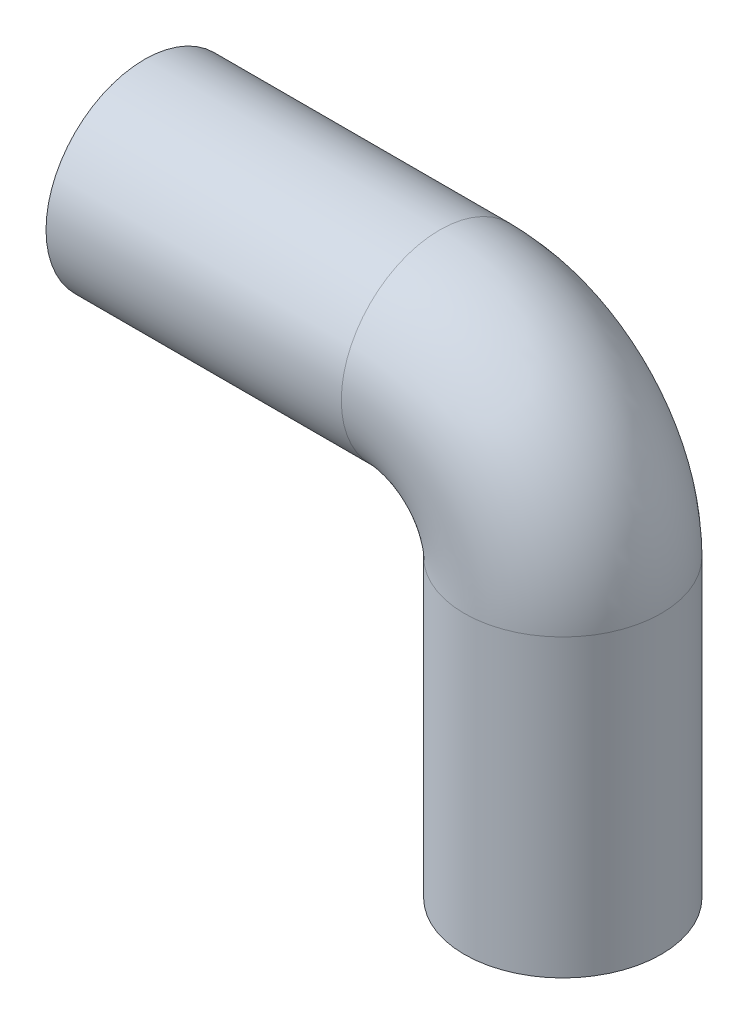
ISO-10303-21;
HEADER;
FILE_DESCRIPTION(('STEP AP214'),'2;1');
FILE_NAME('part.step','',(''),(''),'','','');
FILE_SCHEMA(('AUTOMOTIVE_DESIGN { 1 0 10303 214 1 1 1 1 }'));
ENDSEC;
DATA;
#1=APPLICATION_CONTEXT('core data for automotive mechanical design processes');
#2=APPLICATION_PROTOCOL_DEFINITION('international standard','automotive_design',2000,#1);
#3=PRODUCT_CONTEXT('',#1,'mechanical');
#4=PRODUCT('Part','Part','',(#3));
#5=PRODUCT_RELATED_PRODUCT_CATEGORY('part','',(#4));
#6=PRODUCT_DEFINITION_FORMATION('','',#4);
#7=PRODUCT_DEFINITION_CONTEXT('part definition',#1,'design');
#8=PRODUCT_DEFINITION('design','',#6,#7);
#9=PRODUCT_DEFINITION_SHAPE('','',#8);
#10=(LENGTH_UNIT() NAMED_UNIT(*) SI_UNIT(.MILLI.,.METRE.));
#11=(NAMED_UNIT(*) PLANE_ANGLE_UNIT() SI_UNIT($,.RADIAN.));
#12=(NAMED_UNIT(*) SI_UNIT($,.STERADIAN.) SOLID_ANGLE_UNIT());
#13=UNCERTAINTY_MEASURE_WITH_UNIT(LENGTH_MEASURE(1.E-05),#10,'distance_accuracy_value','');
#14=(GEOMETRIC_REPRESENTATION_CONTEXT(3) GLOBAL_UNCERTAINTY_ASSIGNED_CONTEXT((#13)) GLOBAL_UNIT_ASSIGNED_CONTEXT((#10,
#11,#12)) REPRESENTATION_CONTEXT('',''));
#15=CARTESIAN_POINT('',(0.,0.,0.));
#16=DIRECTION('',(0.,0.,1.));
#17=DIRECTION('',(1.,0.,0.));
#18=AXIS2_PLACEMENT_3D('',#15,#16,#17);
#19=CARTESIAN_POINT('',(0.,0.,0.));
#20=DIRECTION('',(0.,1.,0.));
#21=DIRECTION('',(0.,0.,1.));
#22=AXIS2_PLACEMENT_3D('',#19,#20,#21);
#23=PLANE('',#22);
#24=CARTESIAN_POINT('',(0.,0.,0.));
#25=DIRECTION('',(0.,1.,0.));
#26=DIRECTION('',(0.,0.,1.));
#27=AXIS2_PLACEMENT_3D('',#24,#25,#26);
#28=CIRCLE('',#27,48.26);
#29=CARTESIAN_POINT('',(0.,0.,48.26));
#30=VERTEX_POINT('',#29);
#31=EDGE_CURVE('E67',#30,#30,#28,.T.);
#32=ORIENTED_EDGE('',*,*,#31,.T.);
#33=EDGE_LOOP('',(#32));
#34=FACE_BOUND('',#33,.T.);
#35=CARTESIAN_POINT('',(0.,0.,0.));
#36=DIRECTION('',(0.,1.,0.));
#37=DIRECTION('',(0.,0.,1.));
#38=AXIS2_PLACEMENT_3D('',#35,#36,#37);
#39=CIRCLE('',#38,50.8);
#40=CARTESIAN_POINT('',(0.,0.,50.8));
#41=VERTEX_POINT('',#40);
#42=EDGE_CURVE('E56',#41,#41,#39,.T.);
#43=ORIENTED_EDGE('',*,*,#42,.F.);
#44=EDGE_LOOP('',(#43));
#45=FACE_BOUND('',#44,.T.);
#46=ADVANCED_FACE('F39',(#34,#45),#23,.F.);
#47=CARTESIAN_POINT('',(-215.9,215.9,0.));
#48=DIRECTION('',(-1.,0.,0.));
#49=DIRECTION('',(0.,0.,1.));
#50=AXIS2_PLACEMENT_3D('',#47,#48,#49);
#51=PLANE('',#50);
#52=CARTESIAN_POINT('',(-215.9,215.9,0.));
#53=DIRECTION('',(-1.,0.,0.));
#54=DIRECTION('',(0.,-1.,0.));
#55=AXIS2_PLACEMENT_3D('',#52,#53,#54);
#56=CIRCLE('',#55,48.26);
#57=CARTESIAN_POINT('',(-215.9,167.64,0.));
#58=VERTEX_POINT('',#57);
#59=EDGE_CURVE('E62',#58,#58,#56,.T.);
#60=ORIENTED_EDGE('',*,*,#59,.F.);
#61=EDGE_LOOP('',(#60));
#62=FACE_BOUND('',#61,.T.);
#63=CARTESIAN_POINT('',(-215.9,215.9,0.));
#64=DIRECTION('',(-1.,0.,0.));
#65=DIRECTION('',(0.,0.,1.));
#66=AXIS2_PLACEMENT_3D('',#63,#64,#65);
#67=CIRCLE('',#66,50.8);
#68=CARTESIAN_POINT('',(-215.9,215.9,50.8));
#69=VERTEX_POINT('',#68);
#70=EDGE_CURVE('E10',#69,#69,#67,.T.);
#71=ORIENTED_EDGE('',*,*,#70,.T.);
#72=EDGE_LOOP('',(#71));
#73=FACE_BOUND('',#72,.T.);
#74=ADVANCED_FACE('F106',(#62,#73),#51,.T.);
#75=CARTESIAN_POINT('',(0.,0.,0.));
#76=DIRECTION('',(0.,1.,0.));
#77=DIRECTION('',(0.,0.,1.));
#78=AXIS2_PLACEMENT_3D('',#75,#76,#77);
#79=CYLINDRICAL_SURFACE('',#78,50.8);
#80=CARTESIAN_POINT('',(0.,152.4,0.));
#81=DIRECTION('',(0.,1.,0.));
#82=DIRECTION('',(0.,0.,1.));
#83=AXIS2_PLACEMENT_3D('',#80,#81,#82);
#84=CIRCLE('',#83,50.8);
#85=CARTESIAN_POINT('',(50.8,152.4,0.));
#86=VERTEX_POINT('',#85);
#87=EDGE_CURVE('E51',#86,#86,#84,.T.);
#88=ORIENTED_EDGE('',*,*,#87,.F.);
#89=EDGE_LOOP('',(#88));
#90=FACE_BOUND('',#89,.T.);
#91=ORIENTED_EDGE('',*,*,#42,.T.);
#92=EDGE_LOOP('',(#91));
#93=FACE_BOUND('',#92,.T.);
#94=ADVANCED_FACE('F102',(#90,#93),#79,.T.);
#95=CARTESIAN_POINT('',(-63.5,152.4,0.));
#96=DIRECTION('',(0.,0.,1.));
#97=DIRECTION('',(1.,0.,0.));
#98=AXIS2_PLACEMENT_3D('',#95,#96,#97);
#99=TOROIDAL_SURFACE('',#98,63.5,50.8);
#100=CARTESIAN_POINT('',(-63.5,215.9,0.));
#101=DIRECTION('',(-1.,0.,0.));
#102=DIRECTION('',(0.,0.,1.));
#103=AXIS2_PLACEMENT_3D('',#100,#101,#102);
#104=CIRCLE('',#103,50.8);
#105=CARTESIAN_POINT('',(-63.5,266.7,0.));
#106=VERTEX_POINT('',#105);
#107=EDGE_CURVE('E46',#106,#106,#104,.T.);
#108=CARTESIAN_POINT('',(-63.5,152.4,0.));
#109=DIRECTION('',(0.,0.,1.));
#110=DIRECTION('',(1.,0.,0.));
#111=AXIS2_PLACEMENT_3D('',#108,#109,#110);
#112=CIRCLE('',#111,114.3);
#113=EDGE_CURVE('',#86,#106,#112,.T.);
#114=ORIENTED_EDGE('',*,*,#87,.T.);
#115=ORIENTED_EDGE('',*,*,#107,.F.);
#116=ORIENTED_EDGE('',*,*,#113,.T.);
#117=ORIENTED_EDGE('',*,*,#113,.F.);
#118=EDGE_LOOP('',(#114,#116,#115,#117));
#119=FACE_BOUND('',#118,.T.);
#120=ADVANCED_FACE('F96',(#119),#99,.T.);
#121=CARTESIAN_POINT('',(-63.5,215.9,0.));
#122=DIRECTION('',(-1.,0.,0.));
#123=DIRECTION('',(0.,-1.,0.));
#124=AXIS2_PLACEMENT_3D('',#121,#122,#123);
#125=CYLINDRICAL_SURFACE('',#124,50.8);
#126=ORIENTED_EDGE('',*,*,#70,.F.);
#127=EDGE_LOOP('',(#126));
#128=FACE_BOUND('',#127,.T.);
#129=ORIENTED_EDGE('',*,*,#107,.T.);
#130=EDGE_LOOP('',(#129));
#131=FACE_BOUND('',#130,.T.);
#132=ADVANCED_FACE('F93',(#128,#131),#125,.T.);
#133=CARTESIAN_POINT('',(0.,0.,0.));
#134=DIRECTION('',(0.,1.,0.));
#135=DIRECTION('',(0.,0.,1.));
#136=AXIS2_PLACEMENT_3D('',#133,#134,#135);
#137=CYLINDRICAL_SURFACE('',#136,48.26);
#138=CARTESIAN_POINT('',(0.,152.4,0.));
#139=DIRECTION('',(0.,-1.,0.));
#140=DIRECTION('',(1.,0.,0.));
#141=AXIS2_PLACEMENT_3D('',#138,#139,#140);
#142=CIRCLE('',#141,48.26);
#143=CARTESIAN_POINT('',(48.26,152.4,0.));
#144=VERTEX_POINT('',#143);
#145=EDGE_CURVE('E71',#144,#144,#142,.F.);
#146=ORIENTED_EDGE('',*,*,#145,.T.);
#147=EDGE_LOOP('',(#146));
#148=FACE_BOUND('',#147,.T.);
#149=ORIENTED_EDGE('',*,*,#31,.F.);
#150=EDGE_LOOP('',(#149));
#151=FACE_BOUND('',#150,.T.);
#152=ADVANCED_FACE('F79',(#148,#151),#137,.F.);
#153=CARTESIAN_POINT('',(-63.5,152.4,0.));
#154=DIRECTION('',(0.,0.,1.));
#155=DIRECTION('',(1.,0.,0.));
#156=AXIS2_PLACEMENT_3D('',#153,#154,#155);
#157=TOROIDAL_SURFACE('',#156,63.5,48.26);
#158=CARTESIAN_POINT('',(-63.5,215.9,0.));
#159=DIRECTION('',(-1.,0.,0.));
#160=DIRECTION('',(0.,-1.,0.));
#161=AXIS2_PLACEMENT_3D('',#158,#159,#160);
#162=CIRCLE('',#161,48.26);
#163=CARTESIAN_POINT('',(-63.5,264.16,0.));
#164=VERTEX_POINT('',#163);
#165=EDGE_CURVE('E66',#164,#164,#162,.T.);
#166=CARTESIAN_POINT('',(-63.5,152.4,0.));
#167=DIRECTION('',(0.,0.,1.));
#168=DIRECTION('',(1.,0.,0.));
#169=AXIS2_PLACEMENT_3D('',#166,#167,#168);
#170=CIRCLE('',#169,111.76);
#171=EDGE_CURVE('',#144,#164,#170,.T.);
#172=ORIENTED_EDGE('',*,*,#145,.F.);
#173=ORIENTED_EDGE('',*,*,#165,.T.);
#174=ORIENTED_EDGE('',*,*,#171,.T.);
#175=ORIENTED_EDGE('',*,*,#171,.F.);
#176=EDGE_LOOP('',(#172,#174,#173,#175));
#177=FACE_BOUND('',#176,.T.);
#178=ADVANCED_FACE('F82',(#177),#157,.F.);
#179=CARTESIAN_POINT('',(-63.5,215.9,0.));
#180=DIRECTION('',(-1.,0.,0.));
#181=DIRECTION('',(0.,-1.,0.));
#182=AXIS2_PLACEMENT_3D('',#179,#180,#181);
#183=CYLINDRICAL_SURFACE('',#182,48.26);
#184=ORIENTED_EDGE('',*,*,#59,.T.);
#185=EDGE_LOOP('',(#184));
#186=FACE_BOUND('',#185,.T.);
#187=ORIENTED_EDGE('',*,*,#165,.F.);
#188=EDGE_LOOP('',(#187));
#189=FACE_BOUND('',#188,.T.);
#190=ADVANCED_FACE('F84',(#186,#189),#183,.F.);
#191=CLOSED_SHELL('',(#46,#74,#94,#120,#132,#152,#178,#190));
#192=MANIFOLD_SOLID_BREP('B2',#191);
#193=ADVANCED_BREP_SHAPE_REPRESENTATION('',(#18,#192),#14);
#194=SHAPE_DEFINITION_REPRESENTATION(#9,#193);
ENDSEC;
END-ISO-10303-21;
